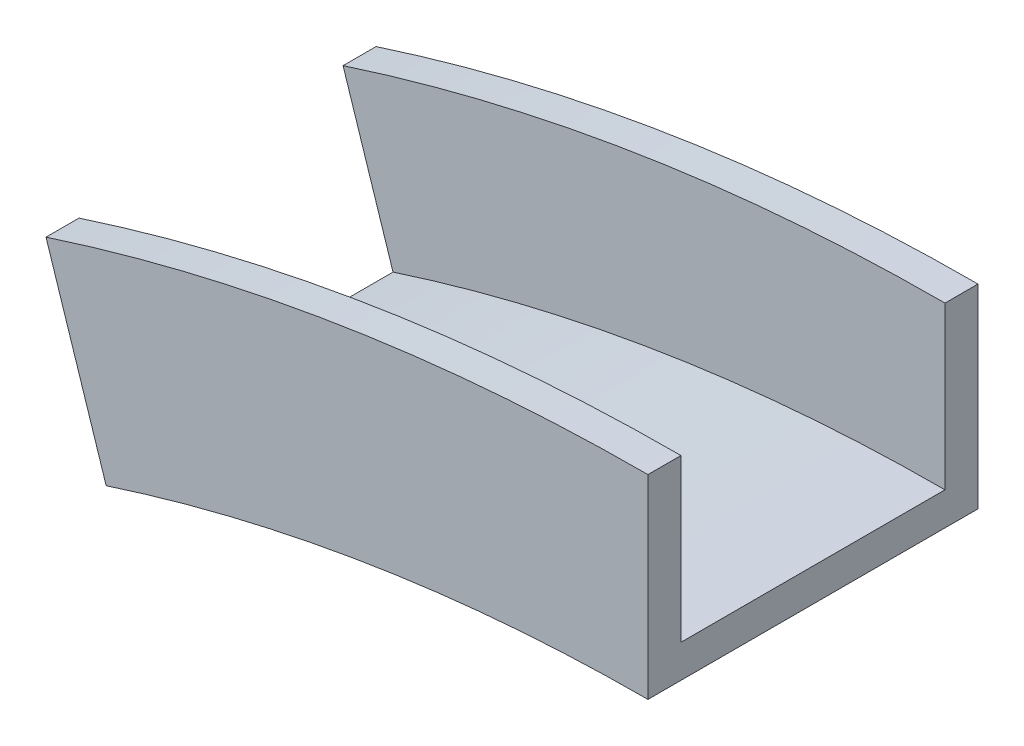
ISO-10303-21;
HEADER;
FILE_DESCRIPTION(('STEP AP214'),'2;1');
FILE_NAME('part.step','',(''),(''),'','','');
FILE_SCHEMA(('AUTOMOTIVE_DESIGN { 1 0 10303 214 1 1 1 1 }'));
ENDSEC;
DATA;
#1=APPLICATION_CONTEXT('core data for automotive mechanical design processes');
#2=APPLICATION_PROTOCOL_DEFINITION('international standard','automotive_design',2000,#1);
#3=PRODUCT_CONTEXT('',#1,'mechanical');
#4=PRODUCT('Part','Part','',(#3));
#5=PRODUCT_RELATED_PRODUCT_CATEGORY('part','',(#4));
#6=PRODUCT_DEFINITION_FORMATION('','',#4);
#7=PRODUCT_DEFINITION_CONTEXT('part definition',#1,'design');
#8=PRODUCT_DEFINITION('design','',#6,#7);
#9=PRODUCT_DEFINITION_SHAPE('','',#8);
#10=(LENGTH_UNIT() NAMED_UNIT(*) SI_UNIT(.MILLI.,.METRE.));
#11=(NAMED_UNIT(*) PLANE_ANGLE_UNIT() SI_UNIT($,.RADIAN.));
#12=(NAMED_UNIT(*) SI_UNIT($,.STERADIAN.) SOLID_ANGLE_UNIT());
#13=UNCERTAINTY_MEASURE_WITH_UNIT(LENGTH_MEASURE(1.E-05),#10,'distance_accuracy_value','');
#14=(GEOMETRIC_REPRESENTATION_CONTEXT(3) GLOBAL_UNCERTAINTY_ASSIGNED_CONTEXT((#13)) GLOBAL_UNIT_ASSIGNED_CONTEXT((#10,
#11,#12)) REPRESENTATION_CONTEXT('',''));
#15=CARTESIAN_POINT('',(0.,0.,0.));
#16=DIRECTION('',(0.,0.,1.));
#17=DIRECTION('',(1.,0.,0.));
#18=AXIS2_PLACEMENT_3D('',#15,#16,#17);
#19=CARTESIAN_POINT('',(-15.3517947499364,47.2479659679716,-0.01));
#20=DIRECTION('',(0.951056516295153,0.309016994374948,0.));
#21=DIRECTION('',(-0.309016994374948,0.951056516295154,0.));
#22=AXIS2_PLACEMENT_3D('',#19,#20,#21);
#23=PLANE('',#22);
#24=DIRECTION('',(0.,0.,-1.));
#25=VECTOR('',#24,1.);
#26=CARTESIAN_POINT('',(-52.1175702033015,160.401387812275,3.175));
#27=LINE('',#26,#25);
#28=CARTESIAN_POINT('',(-52.1175702033015,160.401387812275,0.));
#29=VERTEX_POINT('',#28);
#30=CARTESIAN_POINT('',(-52.1175702033015,160.401387812275,31.75));
#31=VERTEX_POINT('',#30);
#32=EDGE_CURVE('E126',#29,#31,#27,.F.);
#33=ORIENTED_EDGE('',*,*,#32,.T.);
#34=DIRECTION('',(-0.309016994374948,0.951056516295154,0.));
#35=VECTOR('',#34,1.);
#36=CARTESIAN_POINT('',(-3.00267251975222E-13,0.,31.75));
#37=LINE('',#36,#35);
#38=CARTESIAN_POINT('',(-57.9062310504302,178.217054003774,31.75));
#39=VERTEX_POINT('',#38);
#40=EDGE_CURVE('E118',#31,#39,#37,.T.);
#41=ORIENTED_EDGE('',*,*,#40,.T.);
#42=DIRECTION('',(0.,0.,-1.));
#43=VECTOR('',#42,1.);
#44=CARTESIAN_POINT('',(-57.9062310504301,178.217054003774,31.75));
#45=LINE('',#44,#43);
#46=CARTESIAN_POINT('',(-57.9062310504302,178.217054003774,28.575));
#47=VERTEX_POINT('',#46);
#48=EDGE_CURVE('E50',#47,#39,#45,.F.);
#49=ORIENTED_EDGE('',*,*,#48,.F.);
#50=DIRECTION('',(-0.309016994374948,0.951056516295154,0.));
#51=VECTOR('',#50,1.);
#52=CARTESIAN_POINT('',(-3.00267251975222E-13,0.,28.575));
#53=LINE('',#52,#51);
#54=CARTESIAN_POINT('',(-53.0986991604419,163.420992251512,28.575));
#55=VERTEX_POINT('',#54);
#56=EDGE_CURVE('E58',#55,#47,#53,.T.);
#57=ORIENTED_EDGE('',*,*,#56,.F.);
#58=DIRECTION('',(0.,0.,-1.));
#59=VECTOR('',#58,1.);
#60=CARTESIAN_POINT('',(-53.0986991604419,163.420992251512,28.575));
#61=LINE('',#60,#59);
#62=CARTESIAN_POINT('',(-53.0986991604419,163.420992251512,3.175));
#63=VERTEX_POINT('',#62);
#64=EDGE_CURVE('E111',#63,#55,#61,.F.);
#65=ORIENTED_EDGE('',*,*,#64,.F.);
#66=DIRECTION('',(-0.309016994374948,0.951056516295154,0.));
#67=VECTOR('',#66,1.);
#68=CARTESIAN_POINT('',(-3.00267251975222E-13,0.,3.175));
#69=LINE('',#68,#67);
#70=CARTESIAN_POINT('',(-57.9062310504302,178.217054003774,3.175));
#71=VERTEX_POINT('',#70);
#72=EDGE_CURVE('E133',#63,#71,#69,.T.);
#73=ORIENTED_EDGE('',*,*,#72,.T.);
#74=DIRECTION('',(0.,0.,-1.));
#75=VECTOR('',#74,1.);
#76=CARTESIAN_POINT('',(-57.9062310504301,178.217054003774,3.175));
#77=LINE('',#76,#75);
#78=CARTESIAN_POINT('',(-57.9062310504302,178.217054003774,0.));
#79=VERTEX_POINT('',#78);
#80=EDGE_CURVE('E138',#79,#71,#77,.F.);
#81=ORIENTED_EDGE('',*,*,#80,.F.);
#82=DIRECTION('',(-0.309016994374948,0.951056516295154,0.));
#83=VECTOR('',#82,1.);
#84=CARTESIAN_POINT('',(-3.00267251975222E-13,0.,0.));
#85=LINE('',#84,#83);
#86=EDGE_CURVE('E136',#29,#79,#85,.T.);
#87=ORIENTED_EDGE('',*,*,#86,.F.);
#88=EDGE_LOOP('',(#33,#41,#49,#57,#65,#73,#81,#87));
#89=FACE_BOUND('',#88,.T.);
#90=ADVANCED_FACE('F33',(#89),#23,.F.);
#91=CARTESIAN_POINT('',(0.,49.6794513874194,-0.01));
#92=DIRECTION('',(1.,0.,0.));
#93=DIRECTION('',(0.,1.,0.));
#94=AXIS2_PLACEMENT_3D('',#91,#92,#93);
#95=PLANE('',#94);
#96=DIRECTION('',(0.,0.,-1.));
#97=VECTOR('',#96,1.);
#98=CARTESIAN_POINT('',(0.,168.656,3.175));
#99=LINE('',#98,#97);
#100=CARTESIAN_POINT('',(0.,168.656,0.));
#101=VERTEX_POINT('',#100);
#102=CARTESIAN_POINT('',(0.,168.656,31.75));
#103=VERTEX_POINT('',#102);
#104=EDGE_CURVE('E137',#101,#103,#99,.F.);
#105=ORIENTED_EDGE('',*,*,#104,.F.);
#106=DIRECTION('',(0.,1.,0.));
#107=VECTOR('',#106,1.);
#108=CARTESIAN_POINT('',(0.,0.,0.));
#109=LINE('',#108,#107);
#110=CARTESIAN_POINT('',(0.,187.3885,0.));
#111=VERTEX_POINT('',#110);
#112=EDGE_CURVE('E130',#101,#111,#109,.T.);
#113=ORIENTED_EDGE('',*,*,#112,.T.);
#114=DIRECTION('',(0.,0.,-1.));
#115=VECTOR('',#114,1.);
#116=CARTESIAN_POINT('',(0.,187.3885,3.175));
#117=LINE('',#116,#115);
#118=CARTESIAN_POINT('',(0.,187.3885,3.175));
#119=VERTEX_POINT('',#118);
#120=EDGE_CURVE('E127',#111,#119,#117,.F.);
#121=ORIENTED_EDGE('',*,*,#120,.T.);
#122=DIRECTION('',(0.,1.,0.));
#123=VECTOR('',#122,1.);
#124=CARTESIAN_POINT('',(0.,0.,3.175));
#125=LINE('',#124,#123);
#126=CARTESIAN_POINT('',(0.,171.831,3.175));
#127=VERTEX_POINT('',#126);
#128=EDGE_CURVE('E134',#127,#119,#125,.T.);
#129=ORIENTED_EDGE('',*,*,#128,.F.);
#130=DIRECTION('',(0.,0.,-1.));
#131=VECTOR('',#130,1.);
#132=CARTESIAN_POINT('',(0.,171.831,28.575));
#133=LINE('',#132,#131);
#134=CARTESIAN_POINT('',(0.,171.831,28.575));
#135=VERTEX_POINT('',#134);
#136=EDGE_CURVE('E124',#127,#135,#133,.F.);
#137=ORIENTED_EDGE('',*,*,#136,.T.);
#138=DIRECTION('',(0.,1.,0.));
#139=VECTOR('',#138,1.);
#140=CARTESIAN_POINT('',(0.,0.,28.575));
#141=LINE('',#140,#139);
#142=CARTESIAN_POINT('',(0.,187.3885,28.575));
#143=VERTEX_POINT('',#142);
#144=EDGE_CURVE('E116',#135,#143,#141,.T.);
#145=ORIENTED_EDGE('',*,*,#144,.T.);
#146=DIRECTION('',(0.,0.,-1.));
#147=VECTOR('',#146,1.);
#148=CARTESIAN_POINT('',(0.,187.3885,31.75));
#149=LINE('',#148,#147);
#150=CARTESIAN_POINT('',(0.,187.3885,31.75));
#151=VERTEX_POINT('',#150);
#152=EDGE_CURVE('E103',#143,#151,#149,.F.);
#153=ORIENTED_EDGE('',*,*,#152,.T.);
#154=DIRECTION('',(0.,1.,0.));
#155=VECTOR('',#154,1.);
#156=CARTESIAN_POINT('',(0.,0.,31.75));
#157=LINE('',#156,#155);
#158=EDGE_CURVE('E37',#103,#151,#157,.T.);
#159=ORIENTED_EDGE('',*,*,#158,.F.);
#160=EDGE_LOOP('',(#105,#113,#121,#129,#137,#145,#153,#159));
#161=FACE_BOUND('',#160,.T.);
#162=ADVANCED_FACE('F113',(#161),#95,.T.);
#163=CARTESIAN_POINT('',(0.,0.,0.));
#164=DIRECTION('',(0.,0.,1.));
#165=DIRECTION('',(1.,0.,0.));
#166=AXIS2_PLACEMENT_3D('',#163,#164,#165);
#167=PLANE('',#166);
#168=ORIENTED_EDGE('',*,*,#112,.F.);
#169=CARTESIAN_POINT('',(0.,0.,0.));
#170=DIRECTION('',(0.,0.,1.));
#171=DIRECTION('',(1.,0.,0.));
#172=AXIS2_PLACEMENT_3D('',#169,#170,#171);
#173=CIRCLE('',#172,168.656);
#174=EDGE_CURVE('E159',#101,#29,#173,.T.);
#175=ORIENTED_EDGE('',*,*,#174,.T.);
#176=ORIENTED_EDGE('',*,*,#86,.T.);
#177=CARTESIAN_POINT('',(0.,0.,0.));
#178=DIRECTION('',(0.,0.,1.));
#179=DIRECTION('',(1.,0.,0.));
#180=AXIS2_PLACEMENT_3D('',#177,#178,#179);
#181=CIRCLE('',#180,187.3885);
#182=EDGE_CURVE('E161',#111,#79,#181,.T.);
#183=ORIENTED_EDGE('',*,*,#182,.F.);
#184=EDGE_LOOP('',(#168,#175,#176,#183));
#185=FACE_BOUND('',#184,.T.);
#186=ADVANCED_FACE('F173',(#185),#167,.F.);
#187=CARTESIAN_POINT('',(0.,0.,3.175));
#188=DIRECTION('',(0.,0.,1.));
#189=DIRECTION('',(1.,0.,0.));
#190=AXIS2_PLACEMENT_3D('',#187,#188,#189);
#191=PLANE('',#190);
#192=CARTESIAN_POINT('',(0.,0.,3.175));
#193=DIRECTION('',(0.,0.,1.));
#194=DIRECTION('',(1.,0.,0.));
#195=AXIS2_PLACEMENT_3D('',#192,#193,#194);
#196=CIRCLE('',#195,171.831);
#197=EDGE_CURVE('E105',#127,#63,#196,.T.);
#198=ORIENTED_EDGE('',*,*,#197,.F.);
#199=ORIENTED_EDGE('',*,*,#128,.T.);
#200=CARTESIAN_POINT('',(0.,0.,3.175));
#201=DIRECTION('',(0.,0.,1.));
#202=DIRECTION('',(1.,0.,0.));
#203=AXIS2_PLACEMENT_3D('',#200,#201,#202);
#204=CIRCLE('',#203,187.3885);
#205=EDGE_CURVE('E121',#119,#71,#204,.T.);
#206=ORIENTED_EDGE('',*,*,#205,.T.);
#207=ORIENTED_EDGE('',*,*,#72,.F.);
#208=EDGE_LOOP('',(#198,#199,#206,#207));
#209=FACE_BOUND('',#208,.T.);
#210=ADVANCED_FACE('F166',(#209),#191,.T.);
#211=CARTESIAN_POINT('',(0.,0.,3.175));
#212=DIRECTION('',(0.,0.,-1.));
#213=DIRECTION('',(-1.,0.,0.));
#214=AXIS2_PLACEMENT_3D('',#211,#212,#213);
#215=CYLINDRICAL_SURFACE('',#214,168.656);
#216=ORIENTED_EDGE('',*,*,#174,.F.);
#217=ORIENTED_EDGE('',*,*,#104,.T.);
#218=CARTESIAN_POINT('',(0.,0.,31.75));
#219=DIRECTION('',(0.,0.,1.));
#220=DIRECTION('',(1.,0.,0.));
#221=AXIS2_PLACEMENT_3D('',#218,#219,#220);
#222=CIRCLE('',#221,168.656);
#223=EDGE_CURVE('E11',#103,#31,#222,.T.);
#224=ORIENTED_EDGE('',*,*,#223,.T.);
#225=ORIENTED_EDGE('',*,*,#32,.F.);
#226=EDGE_LOOP('',(#216,#217,#224,#225));
#227=FACE_BOUND('',#226,.T.);
#228=ADVANCED_FACE('F175',(#227),#215,.F.);
#229=CARTESIAN_POINT('',(0.,0.,28.575));
#230=DIRECTION('',(0.,0.,-1.));
#231=DIRECTION('',(-1.,0.,0.));
#232=AXIS2_PLACEMENT_3D('',#229,#230,#231);
#233=CYLINDRICAL_SURFACE('',#232,171.831);
#234=ORIENTED_EDGE('',*,*,#136,.F.);
#235=ORIENTED_EDGE('',*,*,#197,.T.);
#236=ORIENTED_EDGE('',*,*,#64,.T.);
#237=CARTESIAN_POINT('',(0.,0.,28.575));
#238=DIRECTION('',(0.,0.,1.));
#239=DIRECTION('',(1.,0.,0.));
#240=AXIS2_PLACEMENT_3D('',#237,#238,#239);
#241=CIRCLE('',#240,171.831);
#242=EDGE_CURVE('E157',#135,#55,#241,.T.);
#243=ORIENTED_EDGE('',*,*,#242,.F.);
#244=EDGE_LOOP('',(#234,#235,#236,#243));
#245=FACE_BOUND('',#244,.T.);
#246=ADVANCED_FACE('F178',(#245),#233,.T.);
#247=CARTESIAN_POINT('',(0.,0.,31.75));
#248=DIRECTION('',(0.,0.,1.));
#249=DIRECTION('',(1.,0.,0.));
#250=AXIS2_PLACEMENT_3D('',#247,#248,#249);
#251=PLANE('',#250);
#252=ORIENTED_EDGE('',*,*,#223,.F.);
#253=ORIENTED_EDGE('',*,*,#158,.T.);
#254=CARTESIAN_POINT('',(0.,0.,31.75));
#255=DIRECTION('',(0.,0.,1.));
#256=DIRECTION('',(1.,0.,0.));
#257=AXIS2_PLACEMENT_3D('',#254,#255,#256);
#258=CIRCLE('',#257,187.3885);
#259=EDGE_CURVE('E100',#151,#39,#258,.T.);
#260=ORIENTED_EDGE('',*,*,#259,.T.);
#261=ORIENTED_EDGE('',*,*,#40,.F.);
#262=EDGE_LOOP('',(#252,#253,#260,#261));
#263=FACE_BOUND('',#262,.T.);
#264=ADVANCED_FACE('F108',(#263),#251,.T.);
#265=CARTESIAN_POINT('',(0.,0.,28.575));
#266=DIRECTION('',(0.,0.,1.));
#267=DIRECTION('',(1.,0.,0.));
#268=AXIS2_PLACEMENT_3D('',#265,#266,#267);
#269=PLANE('',#268);
#270=ORIENTED_EDGE('',*,*,#144,.F.);
#271=ORIENTED_EDGE('',*,*,#242,.T.);
#272=ORIENTED_EDGE('',*,*,#56,.T.);
#273=CARTESIAN_POINT('',(0.,0.,28.575));
#274=DIRECTION('',(0.,0.,1.));
#275=DIRECTION('',(1.,0.,0.));
#276=AXIS2_PLACEMENT_3D('',#273,#274,#275);
#277=CIRCLE('',#276,187.3885);
#278=EDGE_CURVE('E42',#143,#47,#277,.T.);
#279=ORIENTED_EDGE('',*,*,#278,.F.);
#280=EDGE_LOOP('',(#270,#271,#272,#279));
#281=FACE_BOUND('',#280,.T.);
#282=ADVANCED_FACE('F179',(#281),#269,.F.);
#283=CARTESIAN_POINT('',(0.,0.,31.75));
#284=DIRECTION('',(0.,0.,-1.));
#285=DIRECTION('',(-1.,0.,0.));
#286=AXIS2_PLACEMENT_3D('',#283,#284,#285);
#287=CYLINDRICAL_SURFACE('',#286,187.3885);
#288=ORIENTED_EDGE('',*,*,#152,.F.);
#289=ORIENTED_EDGE('',*,*,#278,.T.);
#290=ORIENTED_EDGE('',*,*,#48,.T.);
#291=ORIENTED_EDGE('',*,*,#259,.F.);
#292=EDGE_LOOP('',(#288,#289,#290,#291));
#293=FACE_BOUND('',#292,.T.);
#294=ADVANCED_FACE('F35',(#293),#287,.T.);
#295=CARTESIAN_POINT('',(0.,0.,3.175));
#296=DIRECTION('',(0.,0.,-1.));
#297=DIRECTION('',(-1.,0.,0.));
#298=AXIS2_PLACEMENT_3D('',#295,#296,#297);
#299=CYLINDRICAL_SURFACE('',#298,187.3885);
#300=ORIENTED_EDGE('',*,*,#120,.F.);
#301=ORIENTED_EDGE('',*,*,#182,.T.);
#302=ORIENTED_EDGE('',*,*,#80,.T.);
#303=ORIENTED_EDGE('',*,*,#205,.F.);
#304=EDGE_LOOP('',(#300,#301,#302,#303));
#305=FACE_BOUND('',#304,.T.);
#306=ADVANCED_FACE('F169',(#305),#299,.T.);
#307=CLOSED_SHELL('',(#90,#162,#186,#210,#228,#246,#264,#282,#294,#306));
#308=MANIFOLD_SOLID_BREP('B2',#307);
#309=ADVANCED_BREP_SHAPE_REPRESENTATION('',(#18,#308),#14);
#310=SHAPE_DEFINITION_REPRESENTATION(#9,#309);
ENDSEC;
END-ISO-10303-21;
